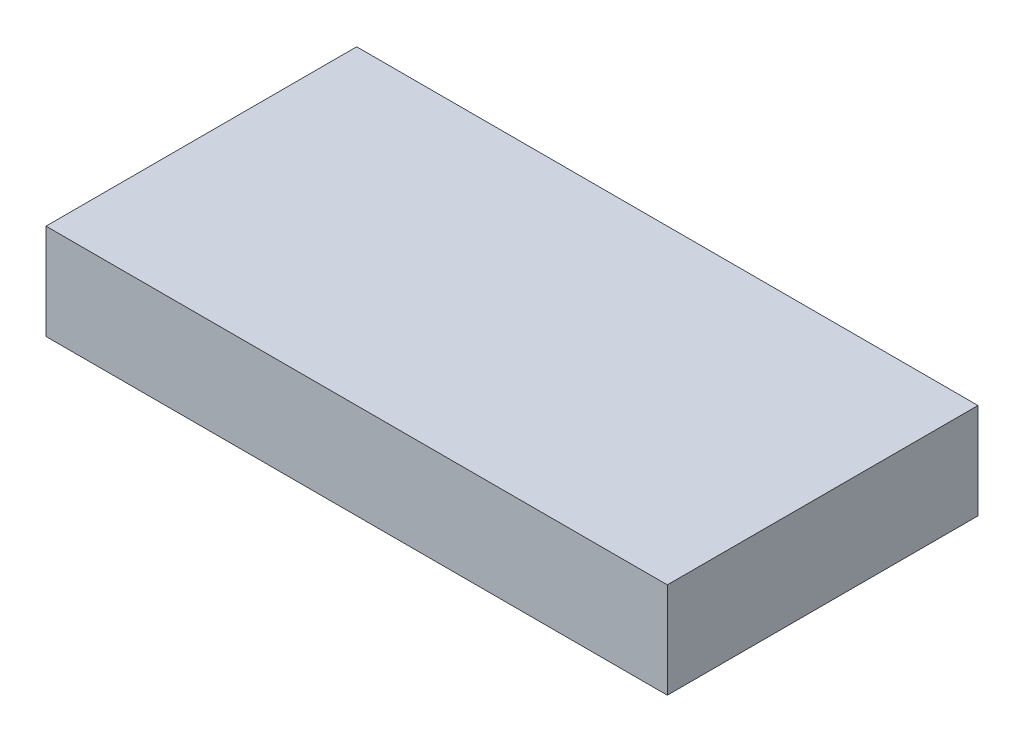
ISO-10303-21;
HEADER;
FILE_DESCRIPTION(('STEP AP214'),'2;1');
FILE_NAME('part.step','',(''),(''),'','','');
FILE_SCHEMA(('AUTOMOTIVE_DESIGN { 1 0 10303 214 1 1 1 1 }'));
ENDSEC;
DATA;
#1=APPLICATION_CONTEXT('core data for automotive mechanical design processes');
#2=APPLICATION_PROTOCOL_DEFINITION('international standard','automotive_design',2000,#1);
#3=PRODUCT_CONTEXT('',#1,'mechanical');
#4=PRODUCT('Part','Part','',(#3));
#5=PRODUCT_RELATED_PRODUCT_CATEGORY('part','',(#4));
#6=PRODUCT_DEFINITION_FORMATION('','',#4);
#7=PRODUCT_DEFINITION_CONTEXT('part definition',#1,'design');
#8=PRODUCT_DEFINITION('design','',#6,#7);
#9=PRODUCT_DEFINITION_SHAPE('','',#8);
#10=(LENGTH_UNIT() NAMED_UNIT(*) SI_UNIT(.MILLI.,.METRE.));
#11=(NAMED_UNIT(*) PLANE_ANGLE_UNIT() SI_UNIT($,.RADIAN.));
#12=(NAMED_UNIT(*) SI_UNIT($,.STERADIAN.) SOLID_ANGLE_UNIT());
#13=UNCERTAINTY_MEASURE_WITH_UNIT(LENGTH_MEASURE(1.E-05),#10,'distance_accuracy_value','');
#14=(GEOMETRIC_REPRESENTATION_CONTEXT(3) GLOBAL_UNCERTAINTY_ASSIGNED_CONTEXT((#13)) GLOBAL_UNIT_ASSIGNED_CONTEXT((#10,
#11,#12)) REPRESENTATION_CONTEXT('',''));
#15=CARTESIAN_POINT('',(0.,0.,0.));
#16=DIRECTION('',(0.,0.,1.));
#17=DIRECTION('',(1.,0.,0.));
#18=AXIS2_PLACEMENT_3D('',#15,#16,#17);
#19=CARTESIAN_POINT('',(0.,20.,0.));
#20=DIRECTION('',(1.,0.,0.));
#21=DIRECTION('',(0.,0.,-1.));
#22=AXIS2_PLACEMENT_3D('',#19,#20,#21);
#23=PLANE('',#22);
#24=DIRECTION('',(0.,0.,1.));
#25=VECTOR('',#24,1.);
#26=CARTESIAN_POINT('',(0.,0.,0.));
#27=LINE('',#26,#25);
#28=CARTESIAN_POINT('',(0.,0.,-65.));
#29=VERTEX_POINT('',#28);
#30=CARTESIAN_POINT('',(0.,0.,0.));
#31=VERTEX_POINT('',#30);
#32=EDGE_CURVE('E107',#29,#31,#27,.T.);
#33=ORIENTED_EDGE('',*,*,#32,.T.);
#34=DIRECTION('',(0.,-1.,0.));
#35=VECTOR('',#34,1.);
#36=CARTESIAN_POINT('',(0.,20.,0.));
#37=LINE('',#36,#35);
#38=CARTESIAN_POINT('',(0.,20.,0.));
#39=VERTEX_POINT('',#38);
#40=EDGE_CURVE('E11',#39,#31,#37,.T.);
#41=ORIENTED_EDGE('',*,*,#40,.F.);
#42=DIRECTION('',(0.,0.,1.));
#43=VECTOR('',#42,1.);
#44=CARTESIAN_POINT('',(0.,20.,0.));
#45=LINE('',#44,#43);
#46=CARTESIAN_POINT('',(0.,20.,-65.));
#47=VERTEX_POINT('',#46);
#48=EDGE_CURVE('E91',#47,#39,#45,.T.);
#49=ORIENTED_EDGE('',*,*,#48,.F.);
#50=DIRECTION('',(0.,-1.,0.));
#51=VECTOR('',#50,1.);
#52=CARTESIAN_POINT('',(0.,20.,-65.));
#53=LINE('',#52,#51);
#54=EDGE_CURVE('E103',#47,#29,#53,.T.);
#55=ORIENTED_EDGE('',*,*,#54,.T.);
#56=EDGE_LOOP('',(#33,#41,#49,#55));
#57=FACE_BOUND('',#56,.T.);
#58=ADVANCED_FACE('F39',(#57),#23,.F.);
#59=CARTESIAN_POINT('',(0.,20.,0.));
#60=DIRECTION('',(0.,0.,-1.));
#61=DIRECTION('',(-1.,0.,0.));
#62=AXIS2_PLACEMENT_3D('',#59,#60,#61);
#63=PLANE('',#62);
#64=DIRECTION('',(1.,0.,0.));
#65=VECTOR('',#64,1.);
#66=CARTESIAN_POINT('',(0.,0.,0.));
#67=LINE('',#66,#65);
#68=CARTESIAN_POINT('',(130.,0.,0.));
#69=VERTEX_POINT('',#68);
#70=EDGE_CURVE('E96',#31,#69,#67,.T.);
#71=ORIENTED_EDGE('',*,*,#70,.T.);
#72=DIRECTION('',(0.,-1.,0.));
#73=VECTOR('',#72,1.);
#74=CARTESIAN_POINT('',(130.,20.,0.));
#75=LINE('',#74,#73);
#76=CARTESIAN_POINT('',(130.,20.,0.));
#77=VERTEX_POINT('',#76);
#78=EDGE_CURVE('E48',#77,#69,#75,.T.);
#79=ORIENTED_EDGE('',*,*,#78,.F.);
#80=DIRECTION('',(1.,0.,0.));
#81=VECTOR('',#80,1.);
#82=CARTESIAN_POINT('',(0.,20.,0.));
#83=LINE('',#82,#81);
#84=EDGE_CURVE('E86',#39,#77,#83,.T.);
#85=ORIENTED_EDGE('',*,*,#84,.F.);
#86=ORIENTED_EDGE('',*,*,#40,.T.);
#87=EDGE_LOOP('',(#71,#79,#85,#86));
#88=FACE_BOUND('',#87,.T.);
#89=ADVANCED_FACE('F95',(#88),#63,.F.);
#90=CARTESIAN_POINT('',(130.,20.,0.));
#91=DIRECTION('',(-1.,0.,0.));
#92=DIRECTION('',(0.,0.,1.));
#93=AXIS2_PLACEMENT_3D('',#90,#91,#92);
#94=PLANE('',#93);
#95=DIRECTION('',(0.,0.,-1.));
#96=VECTOR('',#95,1.);
#97=CARTESIAN_POINT('',(130.,0.,0.));
#98=LINE('',#97,#96);
#99=CARTESIAN_POINT('',(130.,0.,-65.));
#100=VERTEX_POINT('',#99);
#101=EDGE_CURVE('E73',#69,#100,#98,.T.);
#102=ORIENTED_EDGE('',*,*,#101,.T.);
#103=DIRECTION('',(0.,-1.,0.));
#104=VECTOR('',#103,1.);
#105=CARTESIAN_POINT('',(130.,20.,-65.));
#106=LINE('',#105,#104);
#107=CARTESIAN_POINT('',(130.,20.,-65.));
#108=VERTEX_POINT('',#107);
#109=EDGE_CURVE('E98',#108,#100,#106,.T.);
#110=ORIENTED_EDGE('',*,*,#109,.F.);
#111=DIRECTION('',(0.,0.,-1.));
#112=VECTOR('',#111,1.);
#113=CARTESIAN_POINT('',(130.,20.,0.));
#114=LINE('',#113,#112);
#115=EDGE_CURVE('E89',#77,#108,#114,.T.);
#116=ORIENTED_EDGE('',*,*,#115,.F.);
#117=ORIENTED_EDGE('',*,*,#78,.T.);
#118=EDGE_LOOP('',(#102,#110,#116,#117));
#119=FACE_BOUND('',#118,.T.);
#120=ADVANCED_FACE('F99',(#119),#94,.F.);
#121=CARTESIAN_POINT('',(0.,20.,-65.));
#122=DIRECTION('',(0.,0.,1.));
#123=DIRECTION('',(1.,0.,0.));
#124=AXIS2_PLACEMENT_3D('',#121,#122,#123);
#125=PLANE('',#124);
#126=DIRECTION('',(-1.,0.,0.));
#127=VECTOR('',#126,1.);
#128=CARTESIAN_POINT('',(0.,0.,-65.));
#129=LINE('',#128,#127);
#130=EDGE_CURVE('E79',#100,#29,#129,.T.);
#131=ORIENTED_EDGE('',*,*,#130,.T.);
#132=ORIENTED_EDGE('',*,*,#54,.F.);
#133=DIRECTION('',(-1.,0.,0.));
#134=VECTOR('',#133,1.);
#135=CARTESIAN_POINT('',(0.,20.,-65.));
#136=LINE('',#135,#134);
#137=EDGE_CURVE('E56',#108,#47,#136,.T.);
#138=ORIENTED_EDGE('',*,*,#137,.F.);
#139=ORIENTED_EDGE('',*,*,#109,.T.);
#140=EDGE_LOOP('',(#131,#132,#138,#139));
#141=FACE_BOUND('',#140,.T.);
#142=ADVANCED_FACE('F120',(#141),#125,.F.);
#143=CARTESIAN_POINT('',(0.,20.,0.));
#144=DIRECTION('',(0.,-1.,0.));
#145=DIRECTION('',(0.,0.,-1.));
#146=AXIS2_PLACEMENT_3D('',#143,#144,#145);
#147=PLANE('',#146);
#148=ORIENTED_EDGE('',*,*,#48,.T.);
#149=ORIENTED_EDGE('',*,*,#84,.T.);
#150=ORIENTED_EDGE('',*,*,#115,.T.);
#151=ORIENTED_EDGE('',*,*,#137,.T.);
#152=EDGE_LOOP('',(#148,#149,#150,#151));
#153=FACE_BOUND('',#152,.T.);
#154=ADVANCED_FACE('F87',(#153),#147,.F.);
#155=CARTESIAN_POINT('',(0.,0.,0.));
#156=DIRECTION('',(0.,-1.,0.));
#157=DIRECTION('',(0.,0.,-1.));
#158=AXIS2_PLACEMENT_3D('',#155,#156,#157);
#159=PLANE('',#158);
#160=ORIENTED_EDGE('',*,*,#32,.F.);
#161=ORIENTED_EDGE('',*,*,#130,.F.);
#162=ORIENTED_EDGE('',*,*,#101,.F.);
#163=ORIENTED_EDGE('',*,*,#70,.F.);
#164=EDGE_LOOP('',(#160,#161,#162,#163));
#165=FACE_BOUND('',#164,.T.);
#166=ADVANCED_FACE('F123',(#165),#159,.T.);
#167=CLOSED_SHELL('',(#58,#89,#120,#142,#154,#166));
#168=MANIFOLD_SOLID_BREP('B2',#167);
#169=ADVANCED_BREP_SHAPE_REPRESENTATION('',(#18,#168),#14);
#170=SHAPE_DEFINITION_REPRESENTATION(#9,#169);
ENDSEC;
END-ISO-10303-21;
